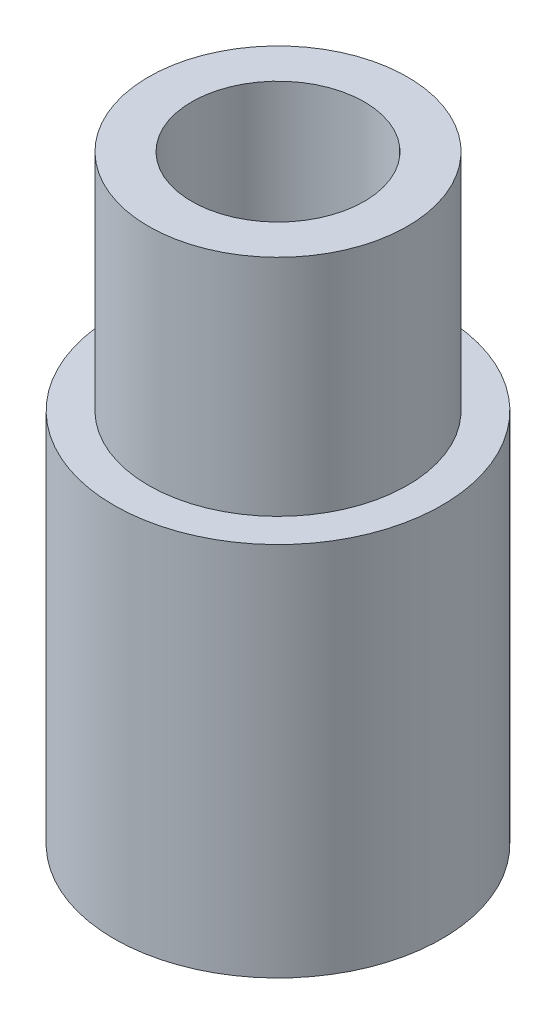
ISO-10303-21;
HEADER;
FILE_DESCRIPTION(('STEP AP214'),'2;1');
FILE_NAME('part.step','',(''),(''),'','','');
FILE_SCHEMA(('AUTOMOTIVE_DESIGN { 1 0 10303 214 1 1 1 1 }'));
ENDSEC;
DATA;
#1=APPLICATION_CONTEXT('core data for automotive mechanical design processes');
#2=APPLICATION_PROTOCOL_DEFINITION('international standard','automotive_design',2000,#1);
#3=PRODUCT_CONTEXT('',#1,'mechanical');
#4=PRODUCT('Part','Part','',(#3));
#5=PRODUCT_RELATED_PRODUCT_CATEGORY('part','',(#4));
#6=PRODUCT_DEFINITION_FORMATION('','',#4);
#7=PRODUCT_DEFINITION_CONTEXT('part definition',#1,'design');
#8=PRODUCT_DEFINITION('design','',#6,#7);
#9=PRODUCT_DEFINITION_SHAPE('','',#8);
#10=(LENGTH_UNIT() NAMED_UNIT(*) SI_UNIT(.MILLI.,.METRE.));
#11=(NAMED_UNIT(*) PLANE_ANGLE_UNIT() SI_UNIT($,.RADIAN.));
#12=(NAMED_UNIT(*) SI_UNIT($,.STERADIAN.) SOLID_ANGLE_UNIT());
#13=UNCERTAINTY_MEASURE_WITH_UNIT(LENGTH_MEASURE(1.E-05),#10,'distance_accuracy_value','');
#14=(GEOMETRIC_REPRESENTATION_CONTEXT(3) GLOBAL_UNCERTAINTY_ASSIGNED_CONTEXT((#13)) GLOBAL_UNIT_ASSIGNED_CONTEXT((#10,
#11,#12)) REPRESENTATION_CONTEXT('',''));
#15=CARTESIAN_POINT('',(0.,0.,0.));
#16=DIRECTION('',(0.,0.,1.));
#17=DIRECTION('',(1.,0.,0.));
#18=AXIS2_PLACEMENT_3D('',#15,#16,#17);
#19=CARTESIAN_POINT('',(0.,6.95,0.));
#20=DIRECTION('',(0.,-1.,0.));
#21=DIRECTION('',(0.,0.,-1.));
#22=AXIS2_PLACEMENT_3D('',#19,#20,#21);
#23=CYLINDRICAL_SURFACE('',#22,1.9);
#24=CARTESIAN_POINT('',(0.,0.,0.));
#25=DIRECTION('',(0.,1.,0.));
#26=DIRECTION('',(0.,0.,1.));
#27=AXIS2_PLACEMENT_3D('',#24,#25,#26);
#28=CIRCLE('',#27,1.9);
#29=CARTESIAN_POINT('',(0.,0.,1.9));
#30=VERTEX_POINT('',#29);
#31=EDGE_CURVE('E12',#30,#30,#28,.T.);
#32=ORIENTED_EDGE('',*,*,#31,.T.);
#33=EDGE_LOOP('',(#32));
#34=FACE_BOUND('',#33,.T.);
#35=CARTESIAN_POINT('',(0.,4.35,0.));
#36=DIRECTION('',(0.,1.,0.));
#37=DIRECTION('',(0.,0.,1.));
#38=AXIS2_PLACEMENT_3D('',#35,#36,#37);
#39=CIRCLE('',#38,1.9);
#40=CARTESIAN_POINT('',(0.,4.35,1.9));
#41=VERTEX_POINT('',#40);
#42=EDGE_CURVE('E36',#41,#41,#39,.T.);
#43=ORIENTED_EDGE('',*,*,#42,.F.);
#44=EDGE_LOOP('',(#43));
#45=FACE_BOUND('',#44,.T.);
#46=ADVANCED_FACE('F33',(#34,#45),#23,.T.);
#47=CARTESIAN_POINT('',(0.,0.,0.));
#48=DIRECTION('',(0.,1.,0.));
#49=DIRECTION('',(0.,0.,1.));
#50=AXIS2_PLACEMENT_3D('',#47,#48,#49);
#51=PLANE('',#50);
#52=CARTESIAN_POINT('',(0.,0.,0.));
#53=DIRECTION('',(0.,-1.,0.));
#54=DIRECTION('',(0.,0.,-1.));
#55=AXIS2_PLACEMENT_3D('',#52,#53,#54);
#56=CIRCLE('',#55,1.);
#57=CARTESIAN_POINT('',(0.,0.,-1.));
#58=VERTEX_POINT('',#57);
#59=EDGE_CURVE('E51',#58,#58,#56,.T.);
#60=ORIENTED_EDGE('',*,*,#59,.F.);
#61=EDGE_LOOP('',(#60));
#62=FACE_BOUND('',#61,.T.);
#63=ORIENTED_EDGE('',*,*,#31,.F.);
#64=EDGE_LOOP('',(#63));
#65=FACE_BOUND('',#64,.T.);
#66=ADVANCED_FACE('F66',(#62,#65),#51,.F.);
#67=CARTESIAN_POINT('',(0.,4.35,0.));
#68=DIRECTION('',(0.,1.,0.));
#69=DIRECTION('',(0.,0.,1.));
#70=AXIS2_PLACEMENT_3D('',#67,#68,#69);
#71=PLANE('',#70);
#72=CARTESIAN_POINT('',(0.,4.35,0.));
#73=DIRECTION('',(0.,1.,0.));
#74=DIRECTION('',(0.,0.,1.));
#75=AXIS2_PLACEMENT_3D('',#72,#73,#74);
#76=CIRCLE('',#75,1.5);
#77=CARTESIAN_POINT('',(0.,4.35,1.5));
#78=VERTEX_POINT('',#77);
#79=EDGE_CURVE('E43',#78,#78,#76,.F.);
#80=ORIENTED_EDGE('',*,*,#79,.T.);
#81=EDGE_LOOP('',(#80));
#82=FACE_BOUND('',#81,.T.);
#83=ORIENTED_EDGE('',*,*,#42,.T.);
#84=EDGE_LOOP('',(#83));
#85=FACE_BOUND('',#84,.T.);
#86=ADVANCED_FACE('F69',(#82,#85),#71,.T.);
#87=CARTESIAN_POINT('',(0.,-5.85855702804995,0.));
#88=DIRECTION('',(0.,1.,0.));
#89=DIRECTION('',(0.,0.,1.));
#90=AXIS2_PLACEMENT_3D('',#87,#88,#89);
#91=CYLINDRICAL_SURFACE('',#90,1.5);
#92=ORIENTED_EDGE('',*,*,#79,.F.);
#93=EDGE_LOOP('',(#92));
#94=FACE_BOUND('',#93,.T.);
#95=CARTESIAN_POINT('',(0.,6.95,0.));
#96=DIRECTION('',(0.,1.,0.));
#97=DIRECTION('',(0.,0.,1.));
#98=AXIS2_PLACEMENT_3D('',#95,#96,#97);
#99=CIRCLE('',#98,1.5);
#100=CARTESIAN_POINT('',(0.,6.95,1.5));
#101=VERTEX_POINT('',#100);
#102=EDGE_CURVE('E47',#101,#101,#99,.T.);
#103=ORIENTED_EDGE('',*,*,#102,.F.);
#104=EDGE_LOOP('',(#103));
#105=FACE_BOUND('',#104,.T.);
#106=ADVANCED_FACE('F74',(#94,#105),#91,.T.);
#107=CARTESIAN_POINT('',(0.,6.95,0.));
#108=DIRECTION('',(0.,1.,0.));
#109=DIRECTION('',(0.,0.,1.));
#110=AXIS2_PLACEMENT_3D('',#107,#108,#109);
#111=PLANE('',#110);
#112=CARTESIAN_POINT('',(0.,6.95,0.));
#113=DIRECTION('',(0.,-1.,0.));
#114=DIRECTION('',(0.,0.,-1.));
#115=AXIS2_PLACEMENT_3D('',#112,#113,#114);
#116=CIRCLE('',#115,1.);
#117=CARTESIAN_POINT('',(0.,6.95,-1.));
#118=VERTEX_POINT('',#117);
#119=EDGE_CURVE('E50',#118,#118,#116,.T.);
#120=ORIENTED_EDGE('',*,*,#119,.T.);
#121=EDGE_LOOP('',(#120));
#122=FACE_BOUND('',#121,.T.);
#123=ORIENTED_EDGE('',*,*,#102,.T.);
#124=EDGE_LOOP('',(#123));
#125=FACE_BOUND('',#124,.T.);
#126=ADVANCED_FACE('F57',(#122,#125),#111,.T.);
#127=CARTESIAN_POINT('',(0.,6.95,0.));
#128=DIRECTION('',(0.,-1.,0.));
#129=DIRECTION('',(0.,0.,-1.));
#130=AXIS2_PLACEMENT_3D('',#127,#128,#129);
#131=CYLINDRICAL_SURFACE('',#130,1.);
#132=ORIENTED_EDGE('',*,*,#119,.F.);
#133=EDGE_LOOP('',(#132));
#134=FACE_BOUND('',#133,.T.);
#135=ORIENTED_EDGE('',*,*,#59,.T.);
#136=EDGE_LOOP('',(#135));
#137=FACE_BOUND('',#136,.T.);
#138=ADVANCED_FACE('F60',(#134,#137),#131,.F.);
#139=CLOSED_SHELL('',(#46,#66,#86,#106,#126,#138));
#140=MANIFOLD_SOLID_BREP('B2',#139);
#141=ADVANCED_BREP_SHAPE_REPRESENTATION('',(#18,#140),#14);
#142=SHAPE_DEFINITION_REPRESENTATION(#9,#141);
ENDSEC;
END-ISO-10303-21;
